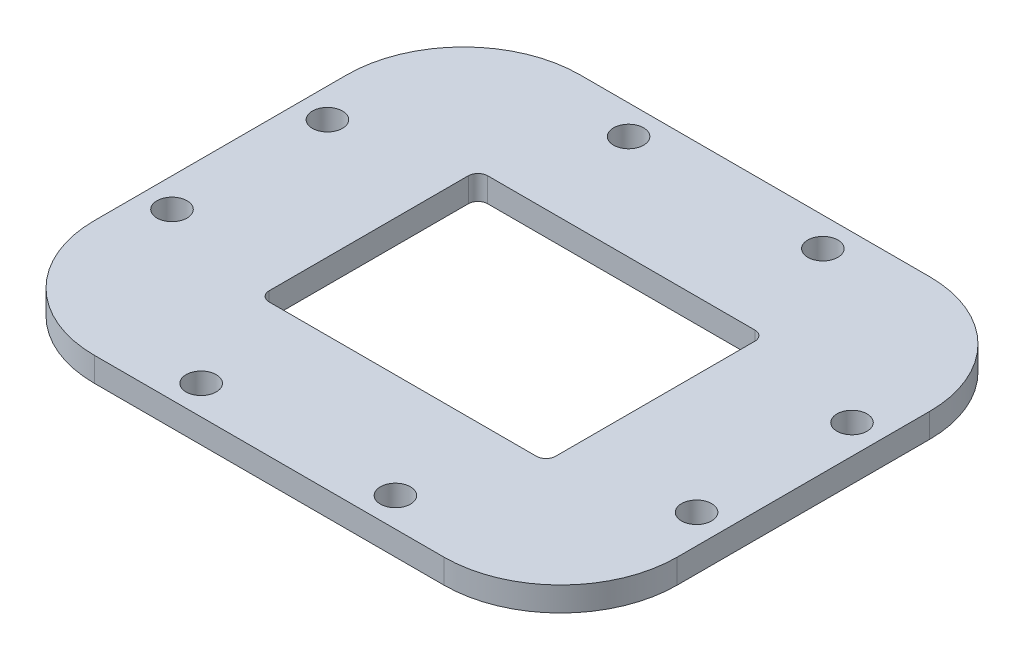
ISO-10303-21;
HEADER;
FILE_DESCRIPTION(('STEP AP214'),'2;1');
FILE_NAME('part.step','',(''),(''),'','','');
FILE_SCHEMA(('AUTOMOTIVE_DESIGN { 1 0 10303 214 1 1 1 1 }'));
ENDSEC;
DATA;
#1=APPLICATION_CONTEXT('core data for automotive mechanical design processes');
#2=APPLICATION_PROTOCOL_DEFINITION('international standard','automotive_design',2000,#1);
#3=PRODUCT_CONTEXT('',#1,'mechanical');
#4=PRODUCT('Part','Part','',(#3));
#5=PRODUCT_RELATED_PRODUCT_CATEGORY('part','',(#4));
#6=PRODUCT_DEFINITION_FORMATION('','',#4);
#7=PRODUCT_DEFINITION_CONTEXT('part definition',#1,'design');
#8=PRODUCT_DEFINITION('design','',#6,#7);
#9=PRODUCT_DEFINITION_SHAPE('','',#8);
#10=(LENGTH_UNIT() NAMED_UNIT(*) SI_UNIT(.MILLI.,.METRE.));
#11=(NAMED_UNIT(*) PLANE_ANGLE_UNIT() SI_UNIT($,.RADIAN.));
#12=(NAMED_UNIT(*) SI_UNIT($,.STERADIAN.) SOLID_ANGLE_UNIT());
#13=UNCERTAINTY_MEASURE_WITH_UNIT(LENGTH_MEASURE(1.E-05),#10,'distance_accuracy_value','');
#14=(GEOMETRIC_REPRESENTATION_CONTEXT(3) GLOBAL_UNCERTAINTY_ASSIGNED_CONTEXT((#13)) GLOBAL_UNIT_ASSIGNED_CONTEXT((#10,
#11,#12)) REPRESENTATION_CONTEXT('',''));
#15=CARTESIAN_POINT('',(0.,0.,0.));
#16=DIRECTION('',(0.,0.,1.));
#17=DIRECTION('',(1.,0.,0.));
#18=AXIS2_PLACEMENT_3D('',#15,#16,#17);
#19=CARTESIAN_POINT('',(0.,2.5,0.));
#20=DIRECTION('',(0.,1.,0.));
#21=DIRECTION('',(0.,0.,1.));
#22=AXIS2_PLACEMENT_3D('',#19,#20,#21);
#23=PLANE('',#22);
#24=CARTESIAN_POINT('',(10.,2.5,22.));
#25=DIRECTION('',(0.,1.,0.));
#26=DIRECTION('',(0.,0.,1.));
#27=AXIS2_PLACEMENT_3D('',#24,#25,#26);
#28=CIRCLE('',#27,1.55);
#29=CARTESIAN_POINT('',(10.,2.5,23.55));
#30=VERTEX_POINT('',#29);
#31=EDGE_CURVE('E278',#30,#30,#28,.T.);
#32=ORIENTED_EDGE('',*,*,#31,.F.);
#33=EDGE_LOOP('',(#32));
#34=FACE_BOUND('',#33,.T.);
#35=CARTESIAN_POINT('',(-10.,2.5,22.));
#36=DIRECTION('',(0.,1.,0.));
#37=DIRECTION('',(0.,0.,1.));
#38=AXIS2_PLACEMENT_3D('',#35,#36,#37);
#39=CIRCLE('',#38,1.55);
#40=CARTESIAN_POINT('',(-10.,2.5,23.55));
#41=VERTEX_POINT('',#40);
#42=EDGE_CURVE('E290',#41,#41,#39,.T.);
#43=ORIENTED_EDGE('',*,*,#42,.F.);
#44=EDGE_LOOP('',(#43));
#45=FACE_BOUND('',#44,.T.);
#46=CARTESIAN_POINT('',(-27.,2.5,8.));
#47=DIRECTION('',(0.,1.,0.));
#48=DIRECTION('',(0.,0.,1.));
#49=AXIS2_PLACEMENT_3D('',#46,#47,#48);
#50=CIRCLE('',#49,1.55);
#51=CARTESIAN_POINT('',(-27.,2.5,9.55));
#52=VERTEX_POINT('',#51);
#53=EDGE_CURVE('E293',#52,#52,#50,.T.);
#54=ORIENTED_EDGE('',*,*,#53,.F.);
#55=EDGE_LOOP('',(#54));
#56=FACE_BOUND('',#55,.T.);
#57=CARTESIAN_POINT('',(-27.,2.5,-8.));
#58=DIRECTION('',(0.,1.,0.));
#59=DIRECTION('',(0.,0.,1.));
#60=AXIS2_PLACEMENT_3D('',#57,#58,#59);
#61=CIRCLE('',#60,1.55);
#62=CARTESIAN_POINT('',(-27.,2.5,-6.45));
#63=VERTEX_POINT('',#62);
#64=EDGE_CURVE('E296',#63,#63,#61,.T.);
#65=ORIENTED_EDGE('',*,*,#64,.F.);
#66=EDGE_LOOP('',(#65));
#67=FACE_BOUND('',#66,.T.);
#68=CARTESIAN_POINT('',(-10.,2.5,-22.));
#69=DIRECTION('',(0.,1.,0.));
#70=DIRECTION('',(0.,0.,1.));
#71=AXIS2_PLACEMENT_3D('',#68,#69,#70);
#72=CIRCLE('',#71,1.55);
#73=CARTESIAN_POINT('',(-10.,2.5,-20.45));
#74=VERTEX_POINT('',#73);
#75=EDGE_CURVE('E299',#74,#74,#72,.T.);
#76=ORIENTED_EDGE('',*,*,#75,.F.);
#77=EDGE_LOOP('',(#76));
#78=FACE_BOUND('',#77,.T.);
#79=CARTESIAN_POINT('',(10.,2.5,-22.));
#80=DIRECTION('',(0.,1.,0.));
#81=DIRECTION('',(0.,0.,1.));
#82=AXIS2_PLACEMENT_3D('',#79,#80,#81);
#83=CIRCLE('',#82,1.55);
#84=CARTESIAN_POINT('',(10.,2.5,-20.45));
#85=VERTEX_POINT('',#84);
#86=EDGE_CURVE('E302',#85,#85,#83,.T.);
#87=ORIENTED_EDGE('',*,*,#86,.F.);
#88=EDGE_LOOP('',(#87));
#89=FACE_BOUND('',#88,.T.);
#90=CARTESIAN_POINT('',(27.,2.5,-8.));
#91=DIRECTION('',(0.,1.,0.));
#92=DIRECTION('',(0.,0.,1.));
#93=AXIS2_PLACEMENT_3D('',#90,#91,#92);
#94=CIRCLE('',#93,1.55);
#95=CARTESIAN_POINT('',(27.,2.5,-6.45));
#96=VERTEX_POINT('',#95);
#97=EDGE_CURVE('E305',#96,#96,#94,.T.);
#98=ORIENTED_EDGE('',*,*,#97,.F.);
#99=EDGE_LOOP('',(#98));
#100=FACE_BOUND('',#99,.T.);
#101=CARTESIAN_POINT('',(27.,2.5,8.));
#102=DIRECTION('',(0.,1.,0.));
#103=DIRECTION('',(0.,0.,1.));
#104=AXIS2_PLACEMENT_3D('',#101,#102,#103);
#105=CIRCLE('',#104,1.55);
#106=CARTESIAN_POINT('',(27.,2.5,9.55));
#107=VERTEX_POINT('',#106);
#108=EDGE_CURVE('E308',#107,#107,#105,.T.);
#109=ORIENTED_EDGE('',*,*,#108,.F.);
#110=EDGE_LOOP('',(#109));
#111=FACE_BOUND('',#110,.T.);
#112=DIRECTION('',(1.,0.,0.));
#113=VECTOR('',#112,1.);
#114=CARTESIAN_POINT('',(-30.,2.5,25.));
#115=LINE('',#114,#113);
#116=CARTESIAN_POINT('',(-18.,2.5,25.));
#117=VERTEX_POINT('',#116);
#118=CARTESIAN_POINT('',(18.,2.5,25.));
#119=VERTEX_POINT('',#118);
#120=EDGE_CURVE('E181',#117,#119,#115,.T.);
#121=ORIENTED_EDGE('',*,*,#120,.T.);
#122=CARTESIAN_POINT('',(18.,2.5,13.));
#123=DIRECTION('',(0.,1.,0.));
#124=DIRECTION('',(0.,0.,1.));
#125=AXIS2_PLACEMENT_3D('',#122,#123,#124);
#126=CIRCLE('',#125,12.);
#127=CARTESIAN_POINT('',(30.,2.5,13.));
#128=VERTEX_POINT('',#127);
#129=EDGE_CURVE('E240',#119,#128,#126,.T.);
#130=ORIENTED_EDGE('',*,*,#129,.T.);
#131=DIRECTION('',(0.,0.,-1.));
#132=VECTOR('',#131,1.);
#133=CARTESIAN_POINT('',(30.,2.5,-25.));
#134=LINE('',#133,#132);
#135=CARTESIAN_POINT('',(30.,2.5,-13.));
#136=VERTEX_POINT('',#135);
#137=EDGE_CURVE('E269',#128,#136,#134,.T.);
#138=ORIENTED_EDGE('',*,*,#137,.T.);
#139=CARTESIAN_POINT('',(18.,2.5,-13.));
#140=DIRECTION('',(0.,1.,0.));
#141=DIRECTION('',(0.,0.,1.));
#142=AXIS2_PLACEMENT_3D('',#139,#140,#141);
#143=CIRCLE('',#142,12.);
#144=CARTESIAN_POINT('',(18.,2.5,-25.));
#145=VERTEX_POINT('',#144);
#146=EDGE_CURVE('E237',#136,#145,#143,.T.);
#147=ORIENTED_EDGE('',*,*,#146,.T.);
#148=DIRECTION('',(-1.,0.,0.));
#149=VECTOR('',#148,1.);
#150=CARTESIAN_POINT('',(-30.,2.5,-25.));
#151=LINE('',#150,#149);
#152=CARTESIAN_POINT('',(-18.,2.5,-25.));
#153=VERTEX_POINT('',#152);
#154=EDGE_CURVE('E254',#145,#153,#151,.T.);
#155=ORIENTED_EDGE('',*,*,#154,.T.);
#156=CARTESIAN_POINT('',(-18.,2.5,-13.));
#157=DIRECTION('',(0.,1.,0.));
#158=DIRECTION('',(0.,0.,1.));
#159=AXIS2_PLACEMENT_3D('',#156,#157,#158);
#160=CIRCLE('',#159,12.);
#161=CARTESIAN_POINT('',(-30.,2.5,-13.));
#162=VERTEX_POINT('',#161);
#163=EDGE_CURVE('E63',#153,#162,#160,.T.);
#164=ORIENTED_EDGE('',*,*,#163,.T.);
#165=DIRECTION('',(0.,0.,1.));
#166=VECTOR('',#165,1.);
#167=CARTESIAN_POINT('',(-30.,2.5,-25.));
#168=LINE('',#167,#166);
#169=CARTESIAN_POINT('',(-30.,2.5,13.));
#170=VERTEX_POINT('',#169);
#171=EDGE_CURVE('E186',#162,#170,#168,.T.);
#172=ORIENTED_EDGE('',*,*,#171,.T.);
#173=CARTESIAN_POINT('',(-18.,2.5,13.));
#174=DIRECTION('',(0.,1.,0.));
#175=DIRECTION('',(0.,0.,1.));
#176=AXIS2_PLACEMENT_3D('',#173,#174,#175);
#177=CIRCLE('',#176,12.);
#178=EDGE_CURVE('E235',#170,#117,#177,.T.);
#179=ORIENTED_EDGE('',*,*,#178,.T.);
#180=EDGE_LOOP('',(#121,#130,#138,#147,#155,#164,#172,#179));
#181=FACE_BOUND('',#180,.T.);
#182=DIRECTION('',(-1.,0.,0.));
#183=VECTOR('',#182,1.);
#184=CARTESIAN_POINT('',(-14.75,2.5,-11.25));
#185=LINE('',#184,#183);
#186=CARTESIAN_POINT('',(13.75,2.5,-11.25));
#187=VERTEX_POINT('',#186);
#188=CARTESIAN_POINT('',(-13.75,2.5,-11.25));
#189=VERTEX_POINT('',#188);
#190=EDGE_CURVE('E283',#187,#189,#185,.T.);
#191=ORIENTED_EDGE('',*,*,#190,.F.);
#192=CARTESIAN_POINT('',(13.75,2.5,-10.25));
#193=DIRECTION('',(0.,1.,0.));
#194=DIRECTION('',(0.,0.,1.));
#195=AXIS2_PLACEMENT_3D('',#192,#193,#194);
#196=CIRCLE('',#195,1.);
#197=CARTESIAN_POINT('',(14.75,2.5,-10.25));
#198=VERTEX_POINT('',#197);
#199=EDGE_CURVE('E167',#187,#198,#196,.F.);
#200=ORIENTED_EDGE('',*,*,#199,.T.);
#201=DIRECTION('',(0.,0.,-1.));
#202=VECTOR('',#201,1.);
#203=CARTESIAN_POINT('',(14.75,2.5,-11.25));
#204=LINE('',#203,#202);
#205=CARTESIAN_POINT('',(14.75,2.5,10.25));
#206=VERTEX_POINT('',#205);
#207=EDGE_CURVE('E272',#206,#198,#204,.T.);
#208=ORIENTED_EDGE('',*,*,#207,.F.);
#209=CARTESIAN_POINT('',(13.75,2.5,10.25));
#210=DIRECTION('',(0.,1.,0.));
#211=DIRECTION('',(0.,0.,1.));
#212=AXIS2_PLACEMENT_3D('',#209,#210,#211);
#213=CIRCLE('',#212,1.);
#214=CARTESIAN_POINT('',(13.75,2.5,11.25));
#215=VERTEX_POINT('',#214);
#216=EDGE_CURVE('E211',#206,#215,#213,.F.);
#217=ORIENTED_EDGE('',*,*,#216,.T.);
#218=DIRECTION('',(1.,0.,0.));
#219=VECTOR('',#218,1.);
#220=CARTESIAN_POINT('',(-14.75,2.5,11.25));
#221=LINE('',#220,#219);
#222=CARTESIAN_POINT('',(-13.75,2.5,11.25));
#223=VERTEX_POINT('',#222);
#224=EDGE_CURVE('E264',#223,#215,#221,.T.);
#225=ORIENTED_EDGE('',*,*,#224,.F.);
#226=CARTESIAN_POINT('',(-13.75,2.5,10.25));
#227=DIRECTION('',(0.,1.,0.));
#228=DIRECTION('',(0.,0.,1.));
#229=AXIS2_PLACEMENT_3D('',#226,#227,#228);
#230=CIRCLE('',#229,1.);
#231=CARTESIAN_POINT('',(-14.75,2.5,10.25));
#232=VERTEX_POINT('',#231);
#233=EDGE_CURVE('E207',#223,#232,#230,.F.);
#234=ORIENTED_EDGE('',*,*,#233,.T.);
#235=DIRECTION('',(0.,0.,1.));
#236=VECTOR('',#235,1.);
#237=CARTESIAN_POINT('',(-14.75,2.5,-11.25));
#238=LINE('',#237,#236);
#239=CARTESIAN_POINT('',(-14.75,2.5,-10.25));
#240=VERTEX_POINT('',#239);
#241=EDGE_CURVE('E281',#240,#232,#238,.T.);
#242=ORIENTED_EDGE('',*,*,#241,.F.);
#243=CARTESIAN_POINT('',(-13.75,2.5,-10.25));
#244=DIRECTION('',(0.,1.,0.));
#245=DIRECTION('',(0.,0.,1.));
#246=AXIS2_PLACEMENT_3D('',#243,#244,#245);
#247=CIRCLE('',#246,1.);
#248=EDGE_CURVE('E166',#240,#189,#247,.F.);
#249=ORIENTED_EDGE('',*,*,#248,.T.);
#250=EDGE_LOOP('',(#191,#200,#208,#217,#225,#234,#242,#249));
#251=FACE_BOUND('',#250,.T.);
#252=ADVANCED_FACE('F41',(#34,#45,#56,#67,#78,#89,#100,#111,#181,#251),#23,.T.);
#253=CARTESIAN_POINT('',(0.,0.,0.));
#254=DIRECTION('',(0.,1.,0.));
#255=DIRECTION('',(0.,0.,1.));
#256=AXIS2_PLACEMENT_3D('',#253,#254,#255);
#257=PLANE('',#256);
#258=CARTESIAN_POINT('',(10.,0.,22.));
#259=DIRECTION('',(0.,-1.,0.));
#260=DIRECTION('',(0.,0.,-1.));
#261=AXIS2_PLACEMENT_3D('',#258,#259,#260);
#262=CIRCLE('',#261,1.55);
#263=CARTESIAN_POINT('',(10.,0.,20.45));
#264=VERTEX_POINT('',#263);
#265=EDGE_CURVE('E314',#264,#264,#262,.T.);
#266=ORIENTED_EDGE('',*,*,#265,.F.);
#267=EDGE_LOOP('',(#266));
#268=FACE_BOUND('',#267,.T.);
#269=CARTESIAN_POINT('',(-10.,0.,22.));
#270=DIRECTION('',(0.,-1.,0.));
#271=DIRECTION('',(0.,0.,1.));
#272=AXIS2_PLACEMENT_3D('',#269,#270,#271);
#273=CIRCLE('',#272,1.55);
#274=CARTESIAN_POINT('',(-10.,0.,23.55));
#275=VERTEX_POINT('',#274);
#276=EDGE_CURVE('E322',#275,#275,#273,.T.);
#277=ORIENTED_EDGE('',*,*,#276,.F.);
#278=EDGE_LOOP('',(#277));
#279=FACE_BOUND('',#278,.T.);
#280=CARTESIAN_POINT('',(-27.,0.,8.));
#281=DIRECTION('',(0.,-1.,0.));
#282=DIRECTION('',(0.,0.,1.));
#283=AXIS2_PLACEMENT_3D('',#280,#281,#282);
#284=CIRCLE('',#283,1.55);
#285=CARTESIAN_POINT('',(-27.,0.,9.55));
#286=VERTEX_POINT('',#285);
#287=EDGE_CURVE('E318',#286,#286,#284,.T.);
#288=ORIENTED_EDGE('',*,*,#287,.F.);
#289=EDGE_LOOP('',(#288));
#290=FACE_BOUND('',#289,.T.);
#291=CARTESIAN_POINT('',(-27.,0.,-8.));
#292=DIRECTION('',(0.,-1.,0.));
#293=DIRECTION('',(0.,0.,-1.));
#294=AXIS2_PLACEMENT_3D('',#291,#292,#293);
#295=CIRCLE('',#294,1.55);
#296=CARTESIAN_POINT('',(-27.,0.,-9.55));
#297=VERTEX_POINT('',#296);
#298=EDGE_CURVE('E315',#297,#297,#295,.T.);
#299=ORIENTED_EDGE('',*,*,#298,.F.);
#300=EDGE_LOOP('',(#299));
#301=FACE_BOUND('',#300,.T.);
#302=CARTESIAN_POINT('',(-10.,0.,-22.));
#303=DIRECTION('',(0.,-1.,0.));
#304=DIRECTION('',(0.,0.,-1.));
#305=AXIS2_PLACEMENT_3D('',#302,#303,#304);
#306=CIRCLE('',#305,1.55);
#307=CARTESIAN_POINT('',(-10.,0.,-23.55));
#308=VERTEX_POINT('',#307);
#309=EDGE_CURVE('E319',#308,#308,#306,.T.);
#310=ORIENTED_EDGE('',*,*,#309,.F.);
#311=EDGE_LOOP('',(#310));
#312=FACE_BOUND('',#311,.T.);
#313=CARTESIAN_POINT('',(10.,0.,-22.));
#314=DIRECTION('',(0.,-1.,0.));
#315=DIRECTION('',(0.,0.,1.));
#316=AXIS2_PLACEMENT_3D('',#313,#314,#315);
#317=CIRCLE('',#316,1.55);
#318=CARTESIAN_POINT('',(10.,0.,-20.45));
#319=VERTEX_POINT('',#318);
#320=EDGE_CURVE('E330',#319,#319,#317,.T.);
#321=ORIENTED_EDGE('',*,*,#320,.F.);
#322=EDGE_LOOP('',(#321));
#323=FACE_BOUND('',#322,.T.);
#324=CARTESIAN_POINT('',(27.,0.,-8.));
#325=DIRECTION('',(0.,-1.,0.));
#326=DIRECTION('',(0.,0.,1.));
#327=AXIS2_PLACEMENT_3D('',#324,#325,#326);
#328=CIRCLE('',#327,1.55);
#329=CARTESIAN_POINT('',(27.,0.,-6.45));
#330=VERTEX_POINT('',#329);
#331=EDGE_CURVE('E327',#330,#330,#328,.T.);
#332=ORIENTED_EDGE('',*,*,#331,.F.);
#333=EDGE_LOOP('',(#332));
#334=FACE_BOUND('',#333,.T.);
#335=CARTESIAN_POINT('',(27.,0.,8.));
#336=DIRECTION('',(0.,-1.,0.));
#337=DIRECTION('',(0.,0.,-1.));
#338=AXIS2_PLACEMENT_3D('',#335,#336,#337);
#339=CIRCLE('',#338,1.55);
#340=CARTESIAN_POINT('',(27.,0.,6.45));
#341=VERTEX_POINT('',#340);
#342=EDGE_CURVE('E311',#341,#341,#339,.T.);
#343=ORIENTED_EDGE('',*,*,#342,.F.);
#344=EDGE_LOOP('',(#343));
#345=FACE_BOUND('',#344,.T.);
#346=DIRECTION('',(0.,0.,-1.));
#347=VECTOR('',#346,1.);
#348=CARTESIAN_POINT('',(30.,0.,-25.));
#349=LINE('',#348,#347);
#350=CARTESIAN_POINT('',(30.,0.,13.));
#351=VERTEX_POINT('',#350);
#352=CARTESIAN_POINT('',(30.,0.,-13.));
#353=VERTEX_POINT('',#352);
#354=EDGE_CURVE('E262',#351,#353,#349,.T.);
#355=ORIENTED_EDGE('',*,*,#354,.F.);
#356=CARTESIAN_POINT('',(18.,0.,13.));
#357=DIRECTION('',(0.,1.,0.));
#358=DIRECTION('',(0.,0.,1.));
#359=AXIS2_PLACEMENT_3D('',#356,#357,#358);
#360=CIRCLE('',#359,12.);
#361=CARTESIAN_POINT('',(18.,0.,25.));
#362=VERTEX_POINT('',#361);
#363=EDGE_CURVE('E228',#351,#362,#360,.F.);
#364=ORIENTED_EDGE('',*,*,#363,.T.);
#365=DIRECTION('',(1.,0.,0.));
#366=VECTOR('',#365,1.);
#367=CARTESIAN_POINT('',(-30.,0.,25.));
#368=LINE('',#367,#366);
#369=CARTESIAN_POINT('',(-18.,0.,25.));
#370=VERTEX_POINT('',#369);
#371=EDGE_CURVE('E189',#370,#362,#368,.T.);
#372=ORIENTED_EDGE('',*,*,#371,.F.);
#373=CARTESIAN_POINT('',(-18.,0.,13.));
#374=DIRECTION('',(0.,1.,0.));
#375=DIRECTION('',(0.,0.,1.));
#376=AXIS2_PLACEMENT_3D('',#373,#374,#375);
#377=CIRCLE('',#376,12.);
#378=CARTESIAN_POINT('',(-30.,0.,13.));
#379=VERTEX_POINT('',#378);
#380=EDGE_CURVE('E222',#370,#379,#377,.F.);
#381=ORIENTED_EDGE('',*,*,#380,.T.);
#382=DIRECTION('',(0.,0.,1.));
#383=VECTOR('',#382,1.);
#384=CARTESIAN_POINT('',(-30.,0.,-25.));
#385=LINE('',#384,#383);
#386=CARTESIAN_POINT('',(-30.,0.,-13.));
#387=VERTEX_POINT('',#386);
#388=EDGE_CURVE('E261',#387,#379,#385,.T.);
#389=ORIENTED_EDGE('',*,*,#388,.F.);
#390=CARTESIAN_POINT('',(-18.,0.,-13.));
#391=DIRECTION('',(0.,1.,0.));
#392=DIRECTION('',(0.,0.,1.));
#393=AXIS2_PLACEMENT_3D('',#390,#391,#392);
#394=CIRCLE('',#393,12.);
#395=CARTESIAN_POINT('',(-18.,0.,-25.));
#396=VERTEX_POINT('',#395);
#397=EDGE_CURVE('E226',#387,#396,#394,.F.);
#398=ORIENTED_EDGE('',*,*,#397,.T.);
#399=DIRECTION('',(-1.,0.,0.));
#400=VECTOR('',#399,1.);
#401=CARTESIAN_POINT('',(-30.,0.,-25.));
#402=LINE('',#401,#400);
#403=CARTESIAN_POINT('',(18.,0.,-25.));
#404=VERTEX_POINT('',#403);
#405=EDGE_CURVE('E252',#404,#396,#402,.T.);
#406=ORIENTED_EDGE('',*,*,#405,.F.);
#407=CARTESIAN_POINT('',(18.,0.,-13.));
#408=DIRECTION('',(0.,1.,0.));
#409=DIRECTION('',(0.,0.,1.));
#410=AXIS2_PLACEMENT_3D('',#407,#408,#409);
#411=CIRCLE('',#410,12.);
#412=EDGE_CURVE('E224',#404,#353,#411,.F.);
#413=ORIENTED_EDGE('',*,*,#412,.T.);
#414=EDGE_LOOP('',(#355,#364,#372,#381,#389,#398,#406,#413));
#415=FACE_BOUND('',#414,.T.);
#416=DIRECTION('',(1.,0.,0.));
#417=VECTOR('',#416,1.);
#418=CARTESIAN_POINT('',(-14.75,0.,11.25));
#419=LINE('',#418,#417);
#420=CARTESIAN_POINT('',(-13.75,0.,11.25));
#421=VERTEX_POINT('',#420);
#422=CARTESIAN_POINT('',(13.75,0.,11.25));
#423=VERTEX_POINT('',#422);
#424=EDGE_CURVE('E177',#421,#423,#419,.T.);
#425=ORIENTED_EDGE('',*,*,#424,.T.);
#426=CARTESIAN_POINT('',(13.75,0.,10.25));
#427=DIRECTION('',(0.,1.,0.));
#428=DIRECTION('',(0.,0.,1.));
#429=AXIS2_PLACEMENT_3D('',#426,#427,#428);
#430=CIRCLE('',#429,1.);
#431=CARTESIAN_POINT('',(14.75,0.,10.25));
#432=VERTEX_POINT('',#431);
#433=EDGE_CURVE('E209',#423,#432,#430,.T.);
#434=ORIENTED_EDGE('',*,*,#433,.T.);
#435=DIRECTION('',(0.,0.,-1.));
#436=VECTOR('',#435,1.);
#437=CARTESIAN_POINT('',(14.75,0.,-11.25));
#438=LINE('',#437,#436);
#439=CARTESIAN_POINT('',(14.75,0.,-10.25));
#440=VERTEX_POINT('',#439);
#441=EDGE_CURVE('E275',#432,#440,#438,.T.);
#442=ORIENTED_EDGE('',*,*,#441,.T.);
#443=CARTESIAN_POINT('',(13.75,0.,-10.25));
#444=DIRECTION('',(0.,1.,0.));
#445=DIRECTION('',(0.,0.,1.));
#446=AXIS2_PLACEMENT_3D('',#443,#444,#445);
#447=CIRCLE('',#446,1.);
#448=CARTESIAN_POINT('',(13.75,0.,-11.25));
#449=VERTEX_POINT('',#448);
#450=EDGE_CURVE('E213',#440,#449,#447,.T.);
#451=ORIENTED_EDGE('',*,*,#450,.T.);
#452=DIRECTION('',(-1.,0.,0.));
#453=VECTOR('',#452,1.);
#454=CARTESIAN_POINT('',(-14.75,0.,-11.25));
#455=LINE('',#454,#453);
#456=CARTESIAN_POINT('',(-13.75,0.,-11.25));
#457=VERTEX_POINT('',#456);
#458=EDGE_CURVE('E161',#449,#457,#455,.T.);
#459=ORIENTED_EDGE('',*,*,#458,.T.);
#460=CARTESIAN_POINT('',(-13.75,0.,-10.25));
#461=DIRECTION('',(0.,1.,0.));
#462=DIRECTION('',(0.,0.,1.));
#463=AXIS2_PLACEMENT_3D('',#460,#461,#462);
#464=CIRCLE('',#463,1.);
#465=CARTESIAN_POINT('',(-14.75,0.,-10.25));
#466=VERTEX_POINT('',#465);
#467=EDGE_CURVE('E155',#457,#466,#464,.T.);
#468=ORIENTED_EDGE('',*,*,#467,.T.);
#469=DIRECTION('',(0.,0.,1.));
#470=VECTOR('',#469,1.);
#471=CARTESIAN_POINT('',(-14.75,0.,-11.25));
#472=LINE('',#471,#470);
#473=CARTESIAN_POINT('',(-14.75,0.,10.25));
#474=VERTEX_POINT('',#473);
#475=EDGE_CURVE('E159',#466,#474,#472,.T.);
#476=ORIENTED_EDGE('',*,*,#475,.T.);
#477=CARTESIAN_POINT('',(-13.75,0.,10.25));
#478=DIRECTION('',(0.,1.,0.));
#479=DIRECTION('',(0.,0.,1.));
#480=AXIS2_PLACEMENT_3D('',#477,#478,#479);
#481=CIRCLE('',#480,1.);
#482=EDGE_CURVE('E205',#474,#421,#481,.T.);
#483=ORIENTED_EDGE('',*,*,#482,.T.);
#484=EDGE_LOOP('',(#425,#434,#442,#451,#459,#468,#476,#483));
#485=FACE_BOUND('',#484,.T.);
#486=ADVANCED_FACE('F158',(#268,#279,#290,#301,#312,#323,#334,#345,#415,#485),#257,.F.);
#487=CARTESIAN_POINT('',(30.,2.5,-25.));
#488=DIRECTION('',(-1.,0.,0.));
#489=DIRECTION('',(0.,0.,1.));
#490=AXIS2_PLACEMENT_3D('',#487,#488,#489);
#491=PLANE('',#490);
#492=ORIENTED_EDGE('',*,*,#137,.F.);
#493=DIRECTION('',(0.,-1.,0.));
#494=VECTOR('',#493,1.);
#495=CARTESIAN_POINT('',(30.,2.5,13.));
#496=LINE('',#495,#494);
#497=EDGE_CURVE('E219',#128,#351,#496,.T.);
#498=ORIENTED_EDGE('',*,*,#497,.T.);
#499=ORIENTED_EDGE('',*,*,#354,.T.);
#500=DIRECTION('',(0.,-1.,0.));
#501=VECTOR('',#500,1.);
#502=CARTESIAN_POINT('',(30.,2.5,-13.));
#503=LINE('',#502,#501);
#504=EDGE_CURVE('E217',#353,#136,#503,.F.);
#505=ORIENTED_EDGE('',*,*,#504,.T.);
#506=EDGE_LOOP('',(#492,#498,#499,#505));
#507=FACE_BOUND('',#506,.T.);
#508=ADVANCED_FACE('F340',(#507),#491,.F.);
#509=CARTESIAN_POINT('',(-30.,2.5,-25.));
#510=DIRECTION('',(0.,0.,1.));
#511=DIRECTION('',(1.,0.,0.));
#512=AXIS2_PLACEMENT_3D('',#509,#510,#511);
#513=PLANE('',#512);
#514=ORIENTED_EDGE('',*,*,#405,.T.);
#515=DIRECTION('',(0.,-1.,0.));
#516=VECTOR('',#515,1.);
#517=CARTESIAN_POINT('',(-18.,2.5,-25.));
#518=LINE('',#517,#516);
#519=EDGE_CURVE('E11',#396,#153,#518,.F.);
#520=ORIENTED_EDGE('',*,*,#519,.T.);
#521=ORIENTED_EDGE('',*,*,#154,.F.);
#522=DIRECTION('',(0.,-1.,0.));
#523=VECTOR('',#522,1.);
#524=CARTESIAN_POINT('',(18.,2.5,-25.));
#525=LINE('',#524,#523);
#526=EDGE_CURVE('E49',#145,#404,#525,.T.);
#527=ORIENTED_EDGE('',*,*,#526,.T.);
#528=EDGE_LOOP('',(#514,#520,#521,#527));
#529=FACE_BOUND('',#528,.T.);
#530=ADVANCED_FACE('F251',(#529),#513,.F.);
#531=CARTESIAN_POINT('',(-30.,2.5,-25.));
#532=DIRECTION('',(1.,0.,0.));
#533=DIRECTION('',(0.,0.,-1.));
#534=AXIS2_PLACEMENT_3D('',#531,#532,#533);
#535=PLANE('',#534);
#536=ORIENTED_EDGE('',*,*,#171,.F.);
#537=DIRECTION('',(0.,-1.,0.));
#538=VECTOR('',#537,1.);
#539=CARTESIAN_POINT('',(-30.,2.5,-13.));
#540=LINE('',#539,#538);
#541=EDGE_CURVE('E243',#162,#387,#540,.T.);
#542=ORIENTED_EDGE('',*,*,#541,.T.);
#543=ORIENTED_EDGE('',*,*,#388,.T.);
#544=DIRECTION('',(0.,-1.,0.));
#545=VECTOR('',#544,1.);
#546=CARTESIAN_POINT('',(-30.,2.5,13.));
#547=LINE('',#546,#545);
#548=EDGE_CURVE('E56',#379,#170,#547,.F.);
#549=ORIENTED_EDGE('',*,*,#548,.T.);
#550=EDGE_LOOP('',(#536,#542,#543,#549));
#551=FACE_BOUND('',#550,.T.);
#552=ADVANCED_FACE('F380',(#551),#535,.F.);
#553=CARTESIAN_POINT('',(-30.,2.5,25.));
#554=DIRECTION('',(0.,0.,-1.));
#555=DIRECTION('',(-1.,0.,0.));
#556=AXIS2_PLACEMENT_3D('',#553,#554,#555);
#557=PLANE('',#556);
#558=ORIENTED_EDGE('',*,*,#371,.T.);
#559=DIRECTION('',(0.,-1.,0.));
#560=VECTOR('',#559,1.);
#561=CARTESIAN_POINT('',(18.,2.5,25.));
#562=LINE('',#561,#560);
#563=EDGE_CURVE('E233',#362,#119,#562,.F.);
#564=ORIENTED_EDGE('',*,*,#563,.T.);
#565=ORIENTED_EDGE('',*,*,#120,.F.);
#566=DIRECTION('',(0.,-1.,0.));
#567=VECTOR('',#566,1.);
#568=CARTESIAN_POINT('',(-18.,2.5,25.));
#569=LINE('',#568,#567);
#570=EDGE_CURVE('E230',#117,#370,#569,.T.);
#571=ORIENTED_EDGE('',*,*,#570,.T.);
#572=EDGE_LOOP('',(#558,#564,#565,#571));
#573=FACE_BOUND('',#572,.T.);
#574=ADVANCED_FACE('F377',(#573),#557,.F.);
#575=CARTESIAN_POINT('',(14.75,2.5,-11.25));
#576=DIRECTION('',(-1.,0.,0.));
#577=DIRECTION('',(0.,0.,1.));
#578=AXIS2_PLACEMENT_3D('',#575,#576,#577);
#579=PLANE('',#578);
#580=ORIENTED_EDGE('',*,*,#441,.F.);
#581=DIRECTION('',(0.,-1.,0.));
#582=VECTOR('',#581,1.);
#583=CARTESIAN_POINT('',(14.75,2.5,10.25));
#584=LINE('',#583,#582);
#585=EDGE_CURVE('E199',#432,#206,#584,.F.);
#586=ORIENTED_EDGE('',*,*,#585,.T.);
#587=ORIENTED_EDGE('',*,*,#207,.T.);
#588=DIRECTION('',(0.,-1.,0.));
#589=VECTOR('',#588,1.);
#590=CARTESIAN_POINT('',(14.75,0.,-10.25));
#591=LINE('',#590,#589);
#592=EDGE_CURVE('E196',#198,#440,#591,.T.);
#593=ORIENTED_EDGE('',*,*,#592,.T.);
#594=EDGE_LOOP('',(#580,#586,#587,#593));
#595=FACE_BOUND('',#594,.T.);
#596=ADVANCED_FACE('F374',(#595),#579,.T.);
#597=CARTESIAN_POINT('',(-14.75,2.5,-11.25));
#598=DIRECTION('',(0.,0.,1.));
#599=DIRECTION('',(1.,0.,0.));
#600=AXIS2_PLACEMENT_3D('',#597,#598,#599);
#601=PLANE('',#600);
#602=ORIENTED_EDGE('',*,*,#458,.F.);
#603=DIRECTION('',(0.,-1.,0.));
#604=VECTOR('',#603,1.);
#605=CARTESIAN_POINT('',(13.75,2.5,-11.25));
#606=LINE('',#605,#604);
#607=EDGE_CURVE('E203',#449,#187,#606,.F.);
#608=ORIENTED_EDGE('',*,*,#607,.T.);
#609=ORIENTED_EDGE('',*,*,#190,.T.);
#610=DIRECTION('',(0.,-1.,0.));
#611=VECTOR('',#610,1.);
#612=CARTESIAN_POINT('',(-13.75,0.,-11.25));
#613=LINE('',#612,#611);
#614=EDGE_CURVE('E201',#189,#457,#613,.T.);
#615=ORIENTED_EDGE('',*,*,#614,.T.);
#616=EDGE_LOOP('',(#602,#608,#609,#615));
#617=FACE_BOUND('',#616,.T.);
#618=ADVANCED_FACE('F443',(#617),#601,.T.);
#619=CARTESIAN_POINT('',(-14.75,2.5,-11.25));
#620=DIRECTION('',(1.,0.,0.));
#621=DIRECTION('',(0.,0.,-1.));
#622=AXIS2_PLACEMENT_3D('',#619,#620,#621);
#623=PLANE('',#622);
#624=ORIENTED_EDGE('',*,*,#241,.T.);
#625=DIRECTION('',(0.,-1.,0.));
#626=VECTOR('',#625,1.);
#627=CARTESIAN_POINT('',(-14.75,0.,10.25));
#628=LINE('',#627,#626);
#629=EDGE_CURVE('E176',#232,#474,#628,.T.);
#630=ORIENTED_EDGE('',*,*,#629,.T.);
#631=ORIENTED_EDGE('',*,*,#475,.F.);
#632=DIRECTION('',(0.,-1.,0.));
#633=VECTOR('',#632,1.);
#634=CARTESIAN_POINT('',(-14.75,2.5,-10.25));
#635=LINE('',#634,#633);
#636=EDGE_CURVE('E173',#466,#240,#635,.F.);
#637=ORIENTED_EDGE('',*,*,#636,.T.);
#638=EDGE_LOOP('',(#624,#630,#631,#637));
#639=FACE_BOUND('',#638,.T.);
#640=ADVANCED_FACE('F172',(#639),#623,.T.);
#641=CARTESIAN_POINT('',(-14.75,2.5,11.25));
#642=DIRECTION('',(0.,0.,-1.));
#643=DIRECTION('',(-1.,0.,0.));
#644=AXIS2_PLACEMENT_3D('',#641,#642,#643);
#645=PLANE('',#644);
#646=ORIENTED_EDGE('',*,*,#424,.F.);
#647=DIRECTION('',(0.,-1.,0.));
#648=VECTOR('',#647,1.);
#649=CARTESIAN_POINT('',(-13.75,2.5,11.25));
#650=LINE('',#649,#648);
#651=EDGE_CURVE('E194',#421,#223,#650,.F.);
#652=ORIENTED_EDGE('',*,*,#651,.T.);
#653=ORIENTED_EDGE('',*,*,#224,.T.);
#654=DIRECTION('',(0.,-1.,0.));
#655=VECTOR('',#654,1.);
#656=CARTESIAN_POINT('',(13.75,0.,11.25));
#657=LINE('',#656,#655);
#658=EDGE_CURVE('E183',#215,#423,#657,.T.);
#659=ORIENTED_EDGE('',*,*,#658,.T.);
#660=EDGE_LOOP('',(#646,#652,#653,#659));
#661=FACE_BOUND('',#660,.T.);
#662=ADVANCED_FACE('F352',(#661),#645,.T.);
#663=CARTESIAN_POINT('',(27.,10.,8.));
#664=DIRECTION('',(0.,-1.,0.));
#665=DIRECTION('',(0.,0.,-1.));
#666=AXIS2_PLACEMENT_3D('',#663,#664,#665);
#667=CYLINDRICAL_SURFACE('',#666,1.55);
#668=ORIENTED_EDGE('',*,*,#108,.T.);
#669=EDGE_LOOP('',(#668));
#670=FACE_BOUND('',#669,.T.);
#671=ORIENTED_EDGE('',*,*,#342,.T.);
#672=EDGE_LOOP('',(#671));
#673=FACE_BOUND('',#672,.T.);
#674=ADVANCED_FACE('F349',(#670,#673),#667,.F.);
#675=CARTESIAN_POINT('',(27.,10.,-8.));
#676=DIRECTION('',(0.,-1.,0.));
#677=DIRECTION('',(0.,0.,-1.));
#678=AXIS2_PLACEMENT_3D('',#675,#676,#677);
#679=CYLINDRICAL_SURFACE('',#678,1.55);
#680=ORIENTED_EDGE('',*,*,#97,.T.);
#681=EDGE_LOOP('',(#680));
#682=FACE_BOUND('',#681,.T.);
#683=ORIENTED_EDGE('',*,*,#331,.T.);
#684=EDGE_LOOP('',(#683));
#685=FACE_BOUND('',#684,.T.);
#686=ADVANCED_FACE('F351',(#682,#685),#679,.F.);
#687=CARTESIAN_POINT('',(10.,10.,-22.));
#688=DIRECTION('',(0.,-1.,0.));
#689=DIRECTION('',(0.,0.,-1.));
#690=AXIS2_PLACEMENT_3D('',#687,#688,#689);
#691=CYLINDRICAL_SURFACE('',#690,1.55);
#692=ORIENTED_EDGE('',*,*,#86,.T.);
#693=EDGE_LOOP('',(#692));
#694=FACE_BOUND('',#693,.T.);
#695=ORIENTED_EDGE('',*,*,#320,.T.);
#696=EDGE_LOOP('',(#695));
#697=FACE_BOUND('',#696,.T.);
#698=ADVANCED_FACE('F358',(#694,#697),#691,.F.);
#699=CARTESIAN_POINT('',(-10.,10.,-22.));
#700=DIRECTION('',(0.,-1.,0.));
#701=DIRECTION('',(0.,0.,-1.));
#702=AXIS2_PLACEMENT_3D('',#699,#700,#701);
#703=CYLINDRICAL_SURFACE('',#702,1.55);
#704=ORIENTED_EDGE('',*,*,#75,.T.);
#705=EDGE_LOOP('',(#704));
#706=FACE_BOUND('',#705,.T.);
#707=ORIENTED_EDGE('',*,*,#309,.T.);
#708=EDGE_LOOP('',(#707));
#709=FACE_BOUND('',#708,.T.);
#710=ADVANCED_FACE('F336',(#706,#709),#703,.F.);
#711=CARTESIAN_POINT('',(-27.,10.,-8.));
#712=DIRECTION('',(0.,-1.,0.));
#713=DIRECTION('',(0.,0.,-1.));
#714=AXIS2_PLACEMENT_3D('',#711,#712,#713);
#715=CYLINDRICAL_SURFACE('',#714,1.55);
#716=ORIENTED_EDGE('',*,*,#64,.T.);
#717=EDGE_LOOP('',(#716));
#718=FACE_BOUND('',#717,.T.);
#719=ORIENTED_EDGE('',*,*,#298,.T.);
#720=EDGE_LOOP('',(#719));
#721=FACE_BOUND('',#720,.T.);
#722=ADVANCED_FACE('F476',(#718,#721),#715,.F.);
#723=CARTESIAN_POINT('',(-27.,10.,8.));
#724=DIRECTION('',(0.,-1.,0.));
#725=DIRECTION('',(0.,0.,-1.));
#726=AXIS2_PLACEMENT_3D('',#723,#724,#725);
#727=CYLINDRICAL_SURFACE('',#726,1.55);
#728=ORIENTED_EDGE('',*,*,#53,.T.);
#729=EDGE_LOOP('',(#728));
#730=FACE_BOUND('',#729,.T.);
#731=ORIENTED_EDGE('',*,*,#287,.T.);
#732=EDGE_LOOP('',(#731));
#733=FACE_BOUND('',#732,.T.);
#734=ADVANCED_FACE('F468',(#730,#733),#727,.F.);
#735=CARTESIAN_POINT('',(-10.,10.,22.));
#736=DIRECTION('',(0.,-1.,0.));
#737=DIRECTION('',(0.,0.,-1.));
#738=AXIS2_PLACEMENT_3D('',#735,#736,#737);
#739=CYLINDRICAL_SURFACE('',#738,1.55);
#740=ORIENTED_EDGE('',*,*,#42,.T.);
#741=EDGE_LOOP('',(#740));
#742=FACE_BOUND('',#741,.T.);
#743=ORIENTED_EDGE('',*,*,#276,.T.);
#744=EDGE_LOOP('',(#743));
#745=FACE_BOUND('',#744,.T.);
#746=ADVANCED_FACE('F459',(#742,#745),#739,.F.);
#747=CARTESIAN_POINT('',(10.,10.,22.));
#748=DIRECTION('',(0.,-1.,0.));
#749=DIRECTION('',(0.,0.,-1.));
#750=AXIS2_PLACEMENT_3D('',#747,#748,#749);
#751=CYLINDRICAL_SURFACE('',#750,1.55);
#752=ORIENTED_EDGE('',*,*,#31,.T.);
#753=EDGE_LOOP('',(#752));
#754=FACE_BOUND('',#753,.T.);
#755=ORIENTED_EDGE('',*,*,#265,.T.);
#756=EDGE_LOOP('',(#755));
#757=FACE_BOUND('',#756,.T.);
#758=ADVANCED_FACE('F393',(#754,#757),#751,.F.);
#759=CARTESIAN_POINT('',(-13.75,2.5,10.25));
#760=DIRECTION('',(0.,1.,0.));
#761=DIRECTION('',(0.,0.,1.));
#762=AXIS2_PLACEMENT_3D('',#759,#760,#761);
#763=CYLINDRICAL_SURFACE('',#762,1.);
#764=ORIENTED_EDGE('',*,*,#233,.F.);
#765=ORIENTED_EDGE('',*,*,#651,.F.);
#766=ORIENTED_EDGE('',*,*,#482,.F.);
#767=ORIENTED_EDGE('',*,*,#629,.F.);
#768=EDGE_LOOP('',(#764,#765,#766,#767));
#769=FACE_BOUND('',#768,.T.);
#770=ADVANCED_FACE('F389',(#769),#763,.F.);
#771=CARTESIAN_POINT('',(13.75,2.5,10.25));
#772=DIRECTION('',(0.,1.,0.));
#773=DIRECTION('',(0.,0.,1.));
#774=AXIS2_PLACEMENT_3D('',#771,#772,#773);
#775=CYLINDRICAL_SURFACE('',#774,1.);
#776=ORIENTED_EDGE('',*,*,#216,.F.);
#777=ORIENTED_EDGE('',*,*,#585,.F.);
#778=ORIENTED_EDGE('',*,*,#433,.F.);
#779=ORIENTED_EDGE('',*,*,#658,.F.);
#780=EDGE_LOOP('',(#776,#777,#778,#779));
#781=FACE_BOUND('',#780,.T.);
#782=ADVANCED_FACE('F392',(#781),#775,.F.);
#783=CARTESIAN_POINT('',(13.75,2.5,-10.25));
#784=DIRECTION('',(0.,1.,0.));
#785=DIRECTION('',(0.,0.,1.));
#786=AXIS2_PLACEMENT_3D('',#783,#784,#785);
#787=CYLINDRICAL_SURFACE('',#786,1.);
#788=ORIENTED_EDGE('',*,*,#199,.F.);
#789=ORIENTED_EDGE('',*,*,#607,.F.);
#790=ORIENTED_EDGE('',*,*,#450,.F.);
#791=ORIENTED_EDGE('',*,*,#592,.F.);
#792=EDGE_LOOP('',(#788,#789,#790,#791));
#793=FACE_BOUND('',#792,.T.);
#794=ADVANCED_FACE('F397',(#793),#787,.F.);
#795=CARTESIAN_POINT('',(-13.75,2.5,-10.25));
#796=DIRECTION('',(0.,1.,0.));
#797=DIRECTION('',(0.,0.,1.));
#798=AXIS2_PLACEMENT_3D('',#795,#796,#797);
#799=CYLINDRICAL_SURFACE('',#798,1.);
#800=ORIENTED_EDGE('',*,*,#248,.F.);
#801=ORIENTED_EDGE('',*,*,#636,.F.);
#802=ORIENTED_EDGE('',*,*,#467,.F.);
#803=ORIENTED_EDGE('',*,*,#614,.F.);
#804=EDGE_LOOP('',(#800,#801,#802,#803));
#805=FACE_BOUND('',#804,.T.);
#806=ADVANCED_FACE('F180',(#805),#799,.F.);
#807=CARTESIAN_POINT('',(18.,2.5,13.));
#808=DIRECTION('',(0.,-1.,0.));
#809=DIRECTION('',(0.,0.,-1.));
#810=AXIS2_PLACEMENT_3D('',#807,#808,#809);
#811=CYLINDRICAL_SURFACE('',#810,12.);
#812=ORIENTED_EDGE('',*,*,#129,.F.);
#813=ORIENTED_EDGE('',*,*,#563,.F.);
#814=ORIENTED_EDGE('',*,*,#363,.F.);
#815=ORIENTED_EDGE('',*,*,#497,.F.);
#816=EDGE_LOOP('',(#812,#813,#814,#815));
#817=FACE_BOUND('',#816,.T.);
#818=ADVANCED_FACE('F403',(#817),#811,.T.);
#819=CARTESIAN_POINT('',(-18.,2.5,-13.));
#820=DIRECTION('',(0.,-1.,0.));
#821=DIRECTION('',(0.,0.,-1.));
#822=AXIS2_PLACEMENT_3D('',#819,#820,#821);
#823=CYLINDRICAL_SURFACE('',#822,12.);
#824=ORIENTED_EDGE('',*,*,#163,.F.);
#825=ORIENTED_EDGE('',*,*,#519,.F.);
#826=ORIENTED_EDGE('',*,*,#397,.F.);
#827=ORIENTED_EDGE('',*,*,#541,.F.);
#828=EDGE_LOOP('',(#824,#825,#826,#827));
#829=FACE_BOUND('',#828,.T.);
#830=ADVANCED_FACE('F406',(#829),#823,.T.);
#831=CARTESIAN_POINT('',(18.,2.5,-13.));
#832=DIRECTION('',(0.,-1.,0.));
#833=DIRECTION('',(0.,0.,-1.));
#834=AXIS2_PLACEMENT_3D('',#831,#832,#833);
#835=CYLINDRICAL_SURFACE('',#834,12.);
#836=ORIENTED_EDGE('',*,*,#146,.F.);
#837=ORIENTED_EDGE('',*,*,#504,.F.);
#838=ORIENTED_EDGE('',*,*,#412,.F.);
#839=ORIENTED_EDGE('',*,*,#526,.F.);
#840=EDGE_LOOP('',(#836,#837,#838,#839));
#841=FACE_BOUND('',#840,.T.);
#842=ADVANCED_FACE('F409',(#841),#835,.T.);
#843=CARTESIAN_POINT('',(-18.,2.5,13.));
#844=DIRECTION('',(0.,-1.,0.));
#845=DIRECTION('',(0.,0.,-1.));
#846=AXIS2_PLACEMENT_3D('',#843,#844,#845);
#847=CYLINDRICAL_SURFACE('',#846,12.);
#848=ORIENTED_EDGE('',*,*,#178,.F.);
#849=ORIENTED_EDGE('',*,*,#548,.F.);
#850=ORIENTED_EDGE('',*,*,#380,.F.);
#851=ORIENTED_EDGE('',*,*,#570,.F.);
#852=EDGE_LOOP('',(#848,#849,#850,#851));
#853=FACE_BOUND('',#852,.T.);
#854=ADVANCED_FACE('F43',(#853),#847,.T.);
#855=CLOSED_SHELL('',(#252,#486,#508,#530,#552,#574,#596,#618,#640,#662,#674,#686,#698,#710,
#722,#734,#746,#758,#770,#782,#794,#806,#818,#830,#842,#854));
#856=MANIFOLD_SOLID_BREP('B2',#855);
#857=ADVANCED_BREP_SHAPE_REPRESENTATION('',(#18,#856),#14);
#858=SHAPE_DEFINITION_REPRESENTATION(#9,#857);
ENDSEC;
END-ISO-10303-21;
